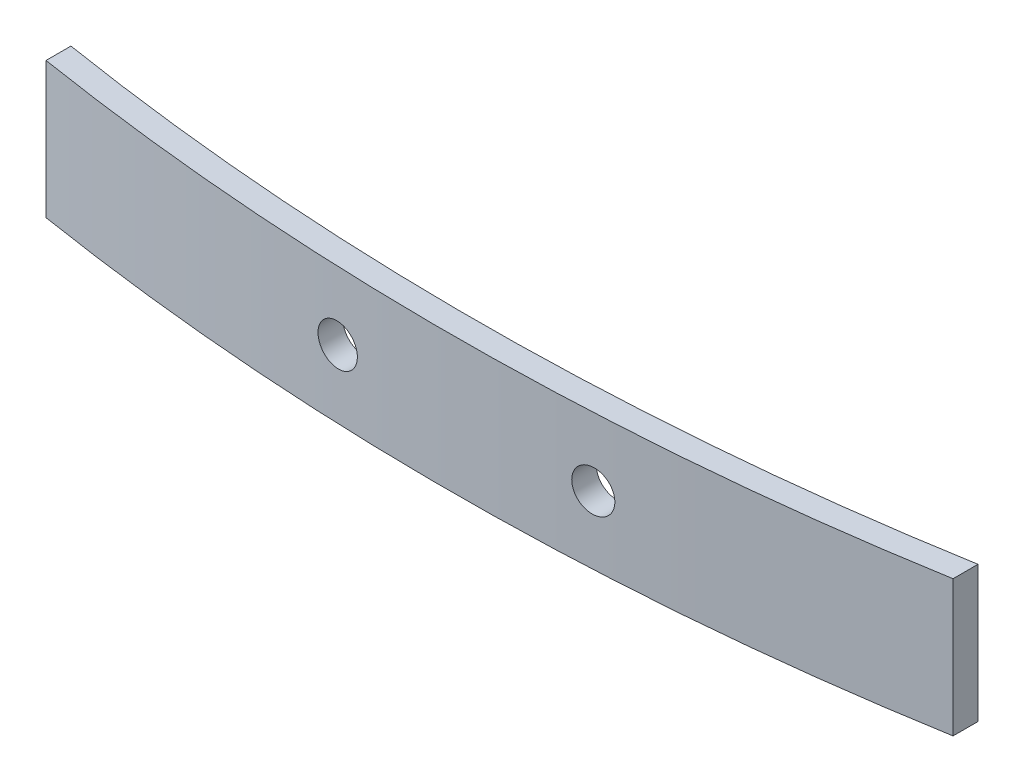
ISO-10303-21;
HEADER;
FILE_DESCRIPTION(('STEP AP214'),'2;1');
FILE_NAME('part.step','',(''),(''),'','','');
FILE_SCHEMA(('AUTOMOTIVE_DESIGN { 1 0 10303 214 1 1 1 1 }'));
ENDSEC;
DATA;
#1=APPLICATION_CONTEXT('core data for automotive mechanical design processes');
#2=APPLICATION_PROTOCOL_DEFINITION('international standard','automotive_design',2000,#1);
#3=PRODUCT_CONTEXT('',#1,'mechanical');
#4=PRODUCT('Part','Part','',(#3));
#5=PRODUCT_RELATED_PRODUCT_CATEGORY('part','',(#4));
#6=PRODUCT_DEFINITION_FORMATION('','',#4);
#7=PRODUCT_DEFINITION_CONTEXT('part definition',#1,'design');
#8=PRODUCT_DEFINITION('design','',#6,#7);
#9=PRODUCT_DEFINITION_SHAPE('','',#8);
#10=(LENGTH_UNIT() NAMED_UNIT(*) SI_UNIT(.MILLI.,.METRE.));
#11=(NAMED_UNIT(*) PLANE_ANGLE_UNIT() SI_UNIT($,.RADIAN.));
#12=(NAMED_UNIT(*) SI_UNIT($,.STERADIAN.) SOLID_ANGLE_UNIT());
#13=UNCERTAINTY_MEASURE_WITH_UNIT(LENGTH_MEASURE(1.E-05),#10,'distance_accuracy_value','');
#14=(GEOMETRIC_REPRESENTATION_CONTEXT(3) GLOBAL_UNCERTAINTY_ASSIGNED_CONTEXT((#13)) GLOBAL_UNIT_ASSIGNED_CONTEXT((#10,
#11,#12)) REPRESENTATION_CONTEXT('',''));
#15=CARTESIAN_POINT('',(0.,0.,0.));
#16=DIRECTION('',(0.,0.,1.));
#17=DIRECTION('',(1.,0.,0.));
#18=AXIS2_PLACEMENT_3D('',#15,#16,#17);
#19=CARTESIAN_POINT('',(-0.864955357188,8.3,-164.510629845193));
#20=DIRECTION('',(0.,-1.,0.));
#21=DIRECTION('',(0.,0.,-1.));
#22=AXIS2_PLACEMENT_3D('',#19,#20,#21);
#23=CYLINDRICAL_SURFACE('',#22,167.210703971618);
#24=CARTESIAN_POINT('',(-0.864955357188,0.,-164.510629845193));
#25=DIRECTION('',(0.,-1.,0.));
#26=DIRECTION('',(0.,0.,1.));
#27=AXIS2_PLACEMENT_3D('',#24,#25,#26);
#28=CIRCLE('',#27,167.210703971618);
#29=CARTESIAN_POINT('',(27.5,0.,0.276653736607457));
#30=VERTEX_POINT('',#29);
#31=CARTESIAN_POINT('',(-27.5,0.,0.565091929874167));
#32=VERTEX_POINT('',#31);
#33=EDGE_CURVE('E119',#30,#32,#28,.T.);
#34=ORIENTED_EDGE('',*,*,#33,.T.);
#35=DIRECTION('',(0.,-1.,0.));
#36=VECTOR('',#35,1.);
#37=CARTESIAN_POINT('',(-27.5,8.3,0.565091929874167));
#38=LINE('',#37,#36);
#39=CARTESIAN_POINT('',(-27.5,8.3,0.565091929874167));
#40=VERTEX_POINT('',#39);
#41=EDGE_CURVE('E11',#40,#32,#38,.T.);
#42=ORIENTED_EDGE('',*,*,#41,.F.);
#43=CARTESIAN_POINT('',(-0.864955357188,8.3,-164.510629845193));
#44=DIRECTION('',(0.,-1.,0.));
#45=DIRECTION('',(0.,0.,1.));
#46=AXIS2_PLACEMENT_3D('',#43,#44,#45);
#47=CIRCLE('',#46,167.210703971618);
#48=CARTESIAN_POINT('',(27.5,8.3,0.276653736607457));
#49=VERTEX_POINT('',#48);
#50=EDGE_CURVE('E101',#49,#40,#47,.T.);
#51=ORIENTED_EDGE('',*,*,#50,.F.);
#52=DIRECTION('',(0.,-1.,0.));
#53=VECTOR('',#52,1.);
#54=CARTESIAN_POINT('',(27.5,8.3,0.276653736607457));
#55=LINE('',#54,#53);
#56=EDGE_CURVE('E115',#49,#30,#55,.T.);
#57=ORIENTED_EDGE('',*,*,#56,.T.);
#58=EDGE_LOOP('',(#34,#42,#51,#57));
#59=FACE_BOUND('',#58,.T.);
#60=CARTESIAN_POINT('',(6.5,4.15,2.53779713115004));
#61=CARTESIAN_POINT('',(6.50000311830072,4.2201600528483,2.53779703356888));
#62=CARTESIAN_POINT('',(6.50592683250922,4.29037097447346,2.53753615101918));
#63=CARTESIAN_POINT('',(6.52947445822004,4.42885834488722,2.53649543364698));
#64=CARTESIAN_POINT('',(6.54711244591845,4.49713236319745,2.5357149744841));
#65=CARTESIAN_POINT('',(6.593583155423,4.6297187466707,2.53364651229168));
#66=CARTESIAN_POINT('',(6.62241033254543,4.69403305576497,2.53235876064082));
#67=CARTESIAN_POINT('',(6.69042977820944,4.81688874962342,2.52929601535595));
#68=CARTESIAN_POINT('',(6.72961948369922,4.87543155699319,2.52752114220171));
#69=CARTESIAN_POINT('',(6.81727240701778,4.98513523567161,2.52351282987057));
#70=CARTESIAN_POINT('',(6.86574015724651,5.03629247755706,2.52127916653188));
#71=CARTESIAN_POINT('',(6.97055942325953,5.12974635220956,2.51639484759461));
#72=CARTESIAN_POINT('',(7.02691128046353,5.17204260105485,2.51374417393686));
#73=CARTESIAN_POINT('',(7.14595131480201,5.24661412268197,2.50807702763504));
#74=CARTESIAN_POINT('',(7.2086452692116,5.27888014756526,2.50506022095671));
#75=CARTESIAN_POINT('',(7.33854573429652,5.33243009041771,2.49873012293615));
#76=CARTESIAN_POINT('',(7.40575226418267,5.35371396163058,2.4954168303317));
#77=CARTESIAN_POINT('',(7.5428494216453,5.38471994256582,2.4885709153848));
#78=CARTESIAN_POINT('',(7.61274294738313,5.39442918509865,2.48503805353334));
#79=CARTESIAN_POINT('',(7.7531616222027,5.40197190758309,2.47785036870086));
#80=CARTESIAN_POINT('',(7.82368677376782,5.39980534082174,2.47419554524016));
#81=CARTESIAN_POINT('',(7.96342985722233,5.38365274089719,2.46686575840938));
#82=CARTESIAN_POINT('',(8.0326466378837,5.36965675272819,2.46319078066725));
#83=CARTESIAN_POINT('',(8.16774794433558,5.33022812559369,2.45593678797151));
#84=CARTESIAN_POINT('',(8.23363245930642,5.30479544949665,2.45235777332949));
#85=CARTESIAN_POINT('',(8.36020377089505,5.24320862112569,2.44541222559091));
#86=CARTESIAN_POINT('',(8.42089009855844,5.20705350283695,2.4420457116723));
#87=CARTESIAN_POINT('',(8.53533088617573,5.12504404492505,2.43564124626815));
#88=CARTESIAN_POINT('',(8.58908537368798,5.07918974386402,2.4326032934764));
#89=CARTESIAN_POINT('',(8.68808413564137,4.97912437454379,2.42696754118702));
#90=CARTESIAN_POINT('',(8.73333590873341,4.92492074717713,2.42436935405706));
#91=CARTESIAN_POINT('',(8.81409389396076,4.80966323539121,2.41970643279685));
#92=CARTESIAN_POINT('',(8.8496001867816,4.74860940769255,2.41764169425003));
#93=CARTESIAN_POINT('',(8.90980168821073,4.62148553155661,2.41412733536457));
#94=CARTESIAN_POINT('',(8.93451353604402,4.55542338906069,2.41267676841059));
#95=CARTESIAN_POINT('',(8.97249675193018,4.4200775166296,2.41044259271686));
#96=CARTESIAN_POINT('',(8.98576822175059,4.3507938153575,2.40965897804425));
#97=CARTESIAN_POINT('',(9.00047882200267,4.21107570744998,2.4087901949542));
#98=CARTESIAN_POINT('',(9.00193452056621,4.14064305088972,2.40870404854379));
#99=CARTESIAN_POINT('',(8.9930154142881,4.00053370594098,2.40923102871897));
#100=CARTESIAN_POINT('',(8.98264065708287,3.93085701450969,2.40984415248887));
#101=CARTESIAN_POINT('',(8.9503655620009,3.79426844369779,2.41174509717095));
#102=CARTESIAN_POINT('',(8.92847026623645,3.72735536859114,2.4130326229213));
#103=CARTESIAN_POINT('',(8.8737837915955,3.59815694385367,2.4162320685688));
#104=CARTESIAN_POINT('',(8.84099258100937,3.53587160769127,2.41814399028308));
#105=CARTESIAN_POINT('',(8.76541982221783,3.41764155961199,2.42252092143321));
#106=CARTESIAN_POINT('',(8.72263037518888,3.36170191310341,2.42498636810516));
#107=CARTESIAN_POINT('',(8.62829367522125,3.2577981137888,2.43037761471364));
#108=CARTESIAN_POINT('',(8.57674634798289,3.20983402865227,2.43330341855572));
#109=CARTESIAN_POINT('',(8.46627103909551,3.12316384761996,2.43951479784418));
#110=CARTESIAN_POINT('',(8.40733179566604,3.08447214599152,2.4428009212656));
#111=CARTESIAN_POINT('',(8.28380750137,3.01753168134166,2.44961536945369));
#112=CARTESIAN_POINT('',(8.21922240939069,2.98928299437351,2.45314369598402));
#113=CARTESIAN_POINT('',(8.08614019581266,2.94399119053169,2.46033126551108));
#114=CARTESIAN_POINT('',(8.0176376688324,2.92696398359887,2.46399068666331));
#115=CARTESIAN_POINT('',(7.87874601955412,2.90466003783105,2.47132140491645));
#116=CARTESIAN_POINT('',(7.80835688551057,2.89938337216909,2.47499270209117));
#117=CARTESIAN_POINT('',(7.66764528599877,2.90073180929488,2.48224190393867));
#118=CARTESIAN_POINT('',(7.59732288570206,2.90736404166644,2.48581975136414));
#119=CARTESIAN_POINT('',(7.45878462599334,2.93235966108019,2.49278235889512));
#120=CARTESIAN_POINT('',(7.39056876893537,2.95072306123143,2.49616711878486));
#121=CARTESIAN_POINT('',(7.25820669782941,2.99865642610158,2.5026575116878));
#122=CARTESIAN_POINT('',(7.19405912200034,3.02822261753584,2.50576323824877));
#123=CARTESIAN_POINT('',(7.07163847251114,3.09772642357956,2.51162544242854));
#124=CARTESIAN_POINT('',(7.01336514139768,3.13766358338107,2.51438193535473));
#125=CARTESIAN_POINT('',(6.9044123768105,3.2267300456736,2.5194854771111));
#126=CARTESIAN_POINT('',(6.85372481706355,3.27584938297113,2.52183296453855));
#127=CARTESIAN_POINT('',(6.76130334568271,3.38193224768082,2.5260782387648));
#128=CARTESIAN_POINT('',(6.71957161192582,3.43889767758814,2.52797591619053));
#129=CARTESIAN_POINT('',(6.64629504219877,3.55899830925378,2.53128701689445));
#130=CARTESIAN_POINT('',(6.614743919168,3.62212967172133,2.53270073907335));
#131=CARTESIAN_POINT('',(6.56272376021015,3.75275215207936,2.53502196922212));
#132=CARTESIAN_POINT('',(6.54224136968559,3.82023790573416,2.5359300872515));
#133=CARTESIAN_POINT('',(6.51840966169869,3.93179630078508,2.53698468836411));
#134=CARTESIAN_POINT('',(6.51151470431355,3.97514204431732,2.53728912928755));
#135=CARTESIAN_POINT('',(6.50230890007655,4.06231856832874,2.53769538112666));
#136=CARTESIAN_POINT('',(6.49999805103457,4.10614934857616,2.53779719213913));
#137=CARTESIAN_POINT('',(6.5,4.15,2.53779713115004));
#138=B_SPLINE_CURVE_WITH_KNOTS('',3,(#60,#61,#62,#63,#64,#65,#66,#67,#68,#69,#70,#71,#72,#73,
#74,#75,#76,#77,#78,#79,#80,#81,#82,#83,#84,#85,#86,#87,#88,#89,#90,#91,#92,#93,#94,#95,#96,#97,
#98,#99,#100,#101,#102,#103,#104,#105,#106,#107,#108,#109,#110,#111,#112,#113,#114,#115,#116,
#117,#118,#119,#120,#121,#122,#123,#124,#125,#126,#127,#128,#129,#130,#131,#132,#133,#134,#135,
#136,#137),.UNSPECIFIED.,.T.,.F.,(4,2,2,2,2,2,2,2,2,2,2,2,2,2,2,2,2,2,2,2,2,2,2,2,2,2,2,2,2,2,2,
2,2,2,2,2,2,2,4),(0.,0.210320035472163,0.420893255693905,0.631362261542145,0.841779258925773,
1.05229931024653,1.2628284809202,1.47355118835342,1.68427479292679,1.89523243521323,
2.10619090729285,2.31732708766128,2.52846395353147,2.7396198470939,2.95077490115542,
3.1617428517856,3.37270905570111,3.58334890570873,3.79398688195663,4.00432944949815,
4.21467117007918,4.424920908374,4.63517125854935,4.84558827603943,5.05600707874424,
5.26675044568951,5.47749534738359,5.68853840640857,5.89958277963837,6.11075354241696,
6.32192454116966,6.53302447718547,6.74411515719746,6.95497806183269,7.16589218613083,
7.3766758095064,7.58720454814038,7.71865648688288,7.8501083628226),.UNSPECIFIED.);
#139=CARTESIAN_POINT('',(6.5,4.15,2.53779713115004));
#140=VERTEX_POINT('',#139);
#141=EDGE_CURVE('E140',#140,#140,#138,.T.);
#142=ORIENTED_EDGE('',*,*,#141,.F.);
#143=EDGE_LOOP('',(#142));
#144=FACE_BOUND('',#143,.T.);
#145=CARTESIAN_POINT('',(-9.,4.15,2.50206599360675));
#146=CARTESIAN_POINT('',(-8.9999968789846,4.22015392659101,2.50206618554172));
#147=CARTESIAN_POINT('',(-8.99407417658717,4.29035873068543,2.50235496193518));
#148=CARTESIAN_POINT('',(-8.97053082535261,4.42883359318577,2.50349920546083));
#149=CARTESIAN_POINT('',(-8.95289609973919,4.4971012202016,2.50435535452016));
#150=CARTESIAN_POINT('',(-8.90643478571085,4.62967430947023,2.50659881430219));
#151=CARTESIAN_POINT('',(-8.87761385256324,4.69398175481704,2.5079858566231));
#152=CARTESIAN_POINT('',(-8.80960947329652,4.81682546464163,2.51123443252684));
#153=CARTESIAN_POINT('',(-8.77042857227543,4.87536314171671,2.51309584956758));
#154=CARTESIAN_POINT('',(-8.68278601070888,4.9850703860922,2.51722102597792));
#155=CARTESIAN_POINT('',(-8.63431808054086,5.036234934716,2.51948505707536));
#156=CARTESIAN_POINT('',(-8.52949361157527,5.12970468199198,2.5243279425006));
#157=CARTESIAN_POINT('',(-8.47313672058647,5.17200948490304,2.52690681088319));
#158=CARTESIAN_POINT('',(-8.35407035350533,5.24660359631099,2.53228748153317));
#159=CARTESIAN_POINT('',(-8.29135420853412,5.27888224334472,2.53508951715917));
#160=CARTESIAN_POINT('',(-8.16139801259883,5.33245139876033,2.54081634269377));
#161=CARTESIAN_POINT('',(-8.09415794839092,5.35374187497259,2.54374113296173));
#162=CARTESIAN_POINT('',(-7.95700562805629,5.38474509749862,2.54961993904171));
#163=CARTESIAN_POINT('',(-7.88709133618139,5.39444883483721,2.55257397579667));
#164=CARTESIAN_POINT('',(-7.74662363106475,5.40197266553775,2.55841906921826));
#165=CARTESIAN_POINT('',(-7.67607021805432,5.39979276320068,2.56131012590768));
#166=CARTESIAN_POINT('',(-7.53631737546828,5.38360795028121,2.56694897423169));
#167=CARTESIAN_POINT('',(-7.46711812818554,5.36960145869888,2.56969674665963));
#168=CARTESIAN_POINT('',(-7.33204995513501,5.33015574247033,2.57497929333489));
#169=CARTESIAN_POINT('',(-7.26618102694138,5.30471652615198,2.57751406773735));
#170=CARTESIAN_POINT('',(-7.13967529197927,5.24313791888805,2.58231262134722));
#171=CARTESIAN_POINT('',(-7.07903622405426,5.20700318245829,2.58457651783571));
#172=CARTESIAN_POINT('',(-6.96468446660637,5.12505256805409,2.58878998227595));
#173=CARTESIAN_POINT('',(-6.9109717504013,5.0792367273757,2.59073955143857));
#174=CARTESIAN_POINT('',(-6.81203747553293,4.97925802415904,2.59428986539865));
#175=CARTESIAN_POINT('',(-6.76681012773489,4.9251008987258,2.59589084813945));
#176=CARTESIAN_POINT('',(-6.68608977992854,4.80995352949493,2.59872223701323));
#177=CARTESIAN_POINT('',(-6.65059674771484,4.7489633083051,2.59995264437223));
#178=CARTESIAN_POINT('',(-6.590376060798,4.62192237655231,2.6020267438483));
#179=CARTESIAN_POINT('',(-6.56564166867781,4.55587486360173,2.60287067800525));
#180=CARTESIAN_POINT('',(-6.52761073193537,4.42056138087808,2.60416370089424));
#181=CARTESIAN_POINT('',(-6.51431415871405,4.35129541915288,2.60461279061355));
#182=CARTESIAN_POINT('',(-6.49954079239336,4.21154064500586,2.60511156027287));
#183=CARTESIAN_POINT('',(-6.49805932903814,4.14105232679781,2.60516139802852));
#184=CARTESIAN_POINT('',(-6.50694607500547,4.00082757280868,2.60486160439767));
#185=CARTESIAN_POINT('',(-6.51731427167745,3.93109113622496,2.60451197343762));
#186=CARTESIAN_POINT('',(-6.54960324564899,3.7943571841506,2.60341671966623));
#187=CARTESIAN_POINT('',(-6.5715228123632,3.72735938244327,2.60267113835048));
#188=CARTESIAN_POINT('',(-6.62628963110505,3.59799583377631,2.60079195620987));
#189=CARTESIAN_POINT('',(-6.65913688578675,3.53563008794169,2.59965835529077));
#190=CARTESIAN_POINT('',(-6.73483166859743,3.41728730499127,2.59701660989913));
#191=CARTESIAN_POINT('',(-6.77768113562152,3.36131150968244,2.59550839280487));
#192=CARTESIAN_POINT('',(-6.87215792978473,3.25734839500569,2.59213873834546));
#193=CARTESIAN_POINT('',(-6.92378527798313,3.20936109480376,2.59027730013288));
#194=CARTESIAN_POINT('',(-7.0343770124007,3.12271195576185,2.58623073710219));
#195=CARTESIAN_POINT('',(-7.09334487425577,3.08405456016075,2.58404545885613));
#196=CARTESIAN_POINT('',(-7.21692291467281,3.01718732082311,2.57939334339435));
#197=CARTESIAN_POINT('',(-7.28153310692913,2.98897750244451,2.57692650549527));
#198=CARTESIAN_POINT('',(-7.41460725247868,2.94378577926695,2.57176305079366));
#199=CARTESIAN_POINT('',(-7.48307375578416,2.92681140084984,2.56906628132723));
#200=CARTESIAN_POINT('',(-7.62187848301808,2.90459846176945,2.56351038955912));
#201=CARTESIAN_POINT('',(-7.69221671793101,2.89935996999512,2.56065126630453));
#202=CARTESIAN_POINT('',(-7.83281637138237,2.90076536385271,2.55484650857032));
#203=CARTESIAN_POINT('',(-7.90307771107605,2.90741691833229,2.55190081946276));
#204=CARTESIAN_POINT('',(-8.04148512738746,2.93242782586422,2.54601247447333));
#205=CARTESIAN_POINT('',(-8.10963119421408,2.95078723310107,2.54306981860556));
#206=CARTESIAN_POINT('',(-8.241895354265,2.99870164424562,2.53728144363261));
#207=CARTESIAN_POINT('',(-8.30601218718679,3.02826013098761,2.53443575498392));
#208=CARTESIAN_POINT('',(-8.42837082553149,3.09773467630274,2.52894039080036));
#209=CARTESIAN_POINT('',(-8.48661286568478,3.13765032082243,2.52629070743512));
#210=CARTESIAN_POINT('',(-8.5955437277431,3.22668945212403,2.52128478020098));
#211=CARTESIAN_POINT('',(-8.64623586141244,3.27580888019099,2.51892840774627));
#212=CARTESIAN_POINT('',(-8.73866512901045,3.38189143455903,2.51459688510446));
#213=CARTESIAN_POINT('',(-8.78040007437305,3.43885647225799,2.51262182809836));
#214=CARTESIAN_POINT('',(-8.85368941957521,3.55896764454512,2.50913246037367));
#215=CARTESIAN_POINT('',(-8.88524832561627,3.62211102701864,2.5076179457325));
#216=CARTESIAN_POINT('',(-8.93727980646051,3.75276028135037,2.50511128627954));
#217=CARTESIAN_POINT('',(-8.95776576458918,3.82026077596767,2.50411851090768));
#218=CARTESIAN_POINT('',(-8.98159577176555,3.931828323578,2.50296166374095));
#219=CARTESIAN_POINT('',(-8.9884886838119,3.97516767163756,2.50262636687851));
#220=CARTESIAN_POINT('',(-8.9976917716211,4.06233138927276,2.50217847191128));
#221=CARTESIAN_POINT('',(-9.00000195054731,4.10615575851357,2.50206587365277));
#222=CARTESIAN_POINT('',(-9.,4.15,2.50206599360675));
#223=B_SPLINE_CURVE_WITH_KNOTS('',3,(#145,#146,#147,#148,#149,#150,#151,#152,#153,#154,#155,
#156,#157,#158,#159,#160,#161,#162,#163,#164,#165,#166,#167,#168,#169,#170,#171,#172,#173,#174,
#175,#176,#177,#178,#179,#180,#181,#182,#183,#184,#185,#186,#187,#188,#189,#190,#191,#192,#193,
#194,#195,#196,#197,#198,#199,#200,#201,#202,#203,#204,#205,#206,#207,#208,#209,#210,#211,#212,
#213,#214,#215,#216,#217,#218,#219,#220,#221,#222),.UNSPECIFIED.,.T.,.F.,(4,2,2,2,2,2,2,2,2,2,2,
2,2,2,2,2,2,2,2,2,2,2,2,2,2,2,2,2,2,2,2,2,2,2,2,2,2,2,4),(0.,0.210301643941587,
0.420856509681721,0.631305066265064,0.841701970625624,1.05224141643252,1.26279026446753,
1.47356224230451,1.68433483720616,1.89527120650513,2.10620749946128,2.3171719952294,
2.52813633732614,2.73900900582891,2.94988086196861,3.16060832361605,3.37133508807649,
3.58192969779077,3.79252378093362,4.00303461668978,4.21354522770696,4.42403378156556,
4.6345223865464,4.84505182796709,5.05558177448261,5.26621178602277,5.47684230879222,
5.68761378604787,5.89838650051611,6.10929520832399,6.32020489223412,6.53118022147071,
6.74214711773653,6.95302119914314,7.16394674622767,7.37477876158737,7.58535538162698,
7.71678811639713,7.84822076044173),.UNSPECIFIED.);
#224=CARTESIAN_POINT('',(-9.,4.15,2.50206599360675));
#225=VERTEX_POINT('',#224);
#226=EDGE_CURVE('E123',#225,#225,#223,.T.);
#227=ORIENTED_EDGE('',*,*,#226,.F.);
#228=EDGE_LOOP('',(#227));
#229=FACE_BOUND('',#228,.T.);
#230=ADVANCED_FACE('F41',(#59,#144,#229),#23,.F.);
#231=CARTESIAN_POINT('',(-0.864955357188,8.3,-164.510629845193));
#232=DIRECTION('',(0.,-1.,0.));
#233=DIRECTION('',(0.,0.,-1.));
#234=AXIS2_PLACEMENT_3D('',#231,#232,#233);
#235=CYLINDRICAL_SURFACE('',#234,168.710703971618);
#236=CARTESIAN_POINT('',(-0.864955357188,0.,-164.510629845193));
#237=DIRECTION('',(0.,1.,0.));
#238=DIRECTION('',(0.,0.,1.));
#239=AXIS2_PLACEMENT_3D('',#236,#237,#238);
#240=CIRCLE('',#239,168.710703971618);
#241=CARTESIAN_POINT('',(-27.5,0.,2.08431615099947));
#242=VERTEX_POINT('',#241);
#243=CARTESIAN_POINT('',(27.5,0.,1.79851284450885));
#244=VERTEX_POINT('',#243);
#245=EDGE_CURVE('E83',#242,#244,#240,.T.);
#246=ORIENTED_EDGE('',*,*,#245,.T.);
#247=DIRECTION('',(0.,-1.,0.));
#248=VECTOR('',#247,1.);
#249=CARTESIAN_POINT('',(27.5,8.3,1.79851284450885));
#250=LINE('',#249,#248);
#251=CARTESIAN_POINT('',(27.5,8.3,1.79851284450885));
#252=VERTEX_POINT('',#251);
#253=EDGE_CURVE('E108',#252,#244,#250,.T.);
#254=ORIENTED_EDGE('',*,*,#253,.F.);
#255=CARTESIAN_POINT('',(-0.864955357188,8.3,-164.510629845193));
#256=DIRECTION('',(0.,1.,0.));
#257=DIRECTION('',(0.,0.,1.));
#258=AXIS2_PLACEMENT_3D('',#255,#256,#257);
#259=CIRCLE('',#258,168.710703971618);
#260=CARTESIAN_POINT('',(-27.5,8.3,2.08431615099947));
#261=VERTEX_POINT('',#260);
#262=EDGE_CURVE('E99',#261,#252,#259,.T.);
#263=ORIENTED_EDGE('',*,*,#262,.F.);
#264=DIRECTION('',(0.,-1.,0.));
#265=VECTOR('',#264,1.);
#266=CARTESIAN_POINT('',(-27.5,8.3,2.08431615099947));
#267=LINE('',#266,#265);
#268=EDGE_CURVE('E57',#261,#242,#267,.T.);
#269=ORIENTED_EDGE('',*,*,#268,.T.);
#270=EDGE_LOOP('',(#246,#254,#263,#269));
#271=FACE_BOUND('',#270,.T.);
#272=CARTESIAN_POINT('',(6.5,4.15,4.03924131223476));
#273=CARTESIAN_POINT('',(6.50000311821644,4.07983900859695,4.03924121552748));
#274=CARTESIAN_POINT('',(6.50592698943899,4.00962714769121,4.03898265006684));
#275=CARTESIAN_POINT('',(6.52947525777152,3.87113790994845,4.03795117528823));
#276=CARTESIAN_POINT('',(6.54711373158644,3.80286296362511,4.0371776471692));
#277=CARTESIAN_POINT('',(6.5935857873165,3.67027474837752,4.03512755161367));
#278=CARTESIAN_POINT('',(6.62241382786342,3.60595953672604,4.03385123316753));
#279=CARTESIAN_POINT('',(6.69043542031096,3.48310215407869,4.03081567544885));
#280=CARTESIAN_POINT('',(6.72962640880317,3.42455856030873,4.02905655559936));
#281=CARTESIAN_POINT('',(6.8172820530594,3.31485390784877,4.02508382682747));
#282=CARTESIAN_POINT('',(6.86575117837123,3.26369642818558,4.02286999882129));
#283=CARTESIAN_POINT('',(6.97057354743463,3.17024232360844,4.01802904805097));
#284=CARTESIAN_POINT('',(7.02692713205723,3.12794608199243,4.01540190741736));
#285=CARTESIAN_POINT('',(7.14596995548139,3.0533755885601,4.00978511600482));
#286=CARTESIAN_POINT('',(7.20866486743313,3.02111041785869,4.00679514013587));
#287=CARTESIAN_POINT('',(7.33856734711277,2.96756235584867,4.0005213413924));
#288=CARTESIAN_POINT('',(7.40577493355283,2.9462795100823,3.99723751729939));
#289=CARTESIAN_POINT('',(7.54287287382637,2.91527615684631,3.9904525607616));
#290=CARTESIAN_POINT('',(7.61276607455011,2.90556828916056,3.98695119514316));
#291=CARTESIAN_POINT('',(7.75318398462447,2.8980281750774,3.97982760071573));
#292=CARTESIAN_POINT('',(7.82370869639393,2.90019597418601,3.97620537144366));
#293=CARTESIAN_POINT('',(7.96344967877755,2.91635077058775,3.96894102179307));
#294=CARTESIAN_POINT('',(8.03266481846192,2.93034754597473,3.96529888743595));
#295=CARTESIAN_POINT('',(8.16776273741988,2.96977719915022,3.95810974015306));
#296=CARTESIAN_POINT('',(8.23364550600481,2.99521011361783,3.95456272753242));
#297=CARTESIAN_POINT('',(8.36021317750195,3.05679674125216,3.94767930532073));
#298=CARTESIAN_POINT('',(8.42089762011192,3.09295140254778,3.94434291438671));
#299=CARTESIAN_POINT('',(8.53533475109379,3.17495920939541,3.93799576571538));
#300=CARTESIAN_POINT('',(8.58908746658606,3.22081231700043,3.93498500670404));
#301=CARTESIAN_POINT('',(8.68808377782325,3.32087531831846,3.92939965986203));
#302=CARTESIAN_POINT('',(8.73333473937803,3.37507790335134,3.92682469465891));
#303=CARTESIAN_POINT('',(8.81409134650165,3.49033280947923,3.92220344736401));
#304=CARTESIAN_POINT('',(8.84959707129266,3.5513850748853,3.92015716097442));
#305=CARTESIAN_POINT('',(8.9097987203869,3.67850714182677,3.91667414586709));
#306=CARTESIAN_POINT('',(8.93451098835277,3.74456917818108,3.91523649564267));
#307=CARTESIAN_POINT('',(8.97249503617838,3.87991472439955,3.9130222036996));
#308=CARTESIAN_POINT('',(8.98576691600336,3.9491982061094,3.91224555620515));
#309=CARTESIAN_POINT('',(9.00047858396002,4.08891761505717,3.91138446160091));
#310=CARTESIAN_POINT('',(9.00193464639936,4.15935182324617,3.91129906241287));
#311=CARTESIAN_POINT('',(8.9930157402488,4.29946432254685,3.91182132938171));
#312=CARTESIAN_POINT('',(8.98264081844691,4.36914261664686,3.91242899279773));
#313=CARTESIAN_POINT('',(8.95036468700418,4.50573494537357,3.91431303885405));
#314=CARTESIAN_POINT('',(8.92846843044031,4.5726501545421,3.91558913413124));
#315=CARTESIAN_POINT('',(8.87377921065577,4.70185269258961,3.91876019569581));
#316=CARTESIAN_POINT('',(8.8409862163099,4.76414000824897,3.92065516375093));
#317=CARTESIAN_POINT('',(8.76540956464805,4.88237282754171,3.92499327057981));
#318=CARTESIAN_POINT('',(8.72261814798466,4.93831335535867,3.92743683503779));
#319=CARTESIAN_POINT('',(8.62827692294248,5.04221853556737,3.93278024197428));
#320=CARTESIAN_POINT('',(8.57672704150597,5.09018312142211,3.93568008825879));
#321=CARTESIAN_POINT('',(8.46624763257672,5.17685250771872,3.94183628410163));
#322=CARTESIAN_POINT('',(8.40730704222217,5.21554316817252,3.94509316715556));
#323=CARTESIAN_POINT('',(8.28378001097383,5.28248131570165,3.95184697684577));
#324=CARTESIAN_POINT('',(8.21919352979874,5.31072872826082,3.95534390519465));
#325=CARTESIAN_POINT('',(8.08611029795493,5.35601708706464,3.96246741698823));
#326=CARTESIAN_POINT('',(8.01760823799984,5.37304240537618,3.9660941738585));
#327=CARTESIAN_POINT('',(7.87871783527179,5.39534282461644,3.97335944682003));
#328=CARTESIAN_POINT('',(7.80832948090368,5.4006178532987,3.97699796298346));
#329=CARTESIAN_POINT('',(7.66762053519389,5.39926646401132,3.98418238604978));
#330=CARTESIAN_POINT('',(7.59730000806059,5.39263304400314,3.98772823722281));
#331=CARTESIAN_POINT('',(7.45876575456234,5.36763572035665,3.99462856946874));
#332=CARTESIAN_POINT('',(7.39055203058462,5.34927180342702,3.9979830503248));
#333=CARTESIAN_POINT('',(7.25819393508083,5.30133802586427,4.00441539585197));
#334=CARTESIAN_POINT('',(7.19404822705777,5.2717718680891,4.00749335151198));
#335=CARTESIAN_POINT('',(7.07163132096953,5.20226884492976,4.0133031329288));
#336=CARTESIAN_POINT('',(7.01335986592901,5.16233243347673,4.01603497382811));
#337=CARTESIAN_POINT('',(6.90440970126537,5.0732674380006,4.02109291899384));
#338=CARTESIAN_POINT('',(6.85372299555039,5.02414865901682,4.02341945098137));
#339=CARTESIAN_POINT('',(6.76130311542266,4.9180673552612,4.02762682906566));
#340=CARTESIAN_POINT('',(6.71957211975892,4.86110292731781,4.02950756672099));
#341=CARTESIAN_POINT('',(6.64629602031458,4.74100352127971,4.03278914867204));
#342=CARTESIAN_POINT('',(6.61474482710605,4.67787226166189,4.03419027989289));
#343=CARTESIAN_POINT('',(6.5627245280606,4.54725012163237,4.03649083798607));
#344=CARTESIAN_POINT('',(6.54224206886014,4.47976460478743,4.03739086942698));
#345=CARTESIAN_POINT('',(6.51841005492601,4.36820601693854,4.03843608951054));
#346=CARTESIAN_POINT('',(6.5115149493841,4.32485980916441,4.03873782494768));
#347=CARTESIAN_POINT('',(6.50230894854312,4.23768235789113,4.03914046648403));
#348=CARTESIAN_POINT('',(6.49999805109272,4.19385111461962,4.0392413726775));
#349=CARTESIAN_POINT('',(6.5,4.15,4.03924131223476));
#350=B_SPLINE_CURVE_WITH_KNOTS('',3,(#272,#273,#274,#275,#276,#277,#278,#279,#280,#281,#282,
#283,#284,#285,#286,#287,#288,#289,#290,#291,#292,#293,#294,#295,#296,#297,#298,#299,#300,#301,
#302,#303,#304,#305,#306,#307,#308,#309,#310,#311,#312,#313,#314,#315,#316,#317,#318,#319,#320,
#321,#322,#323,#324,#325,#326,#327,#328,#329,#330,#331,#332,#333,#334,#335,#336,#337,#338,#339,
#340,#341,#342,#343,#344,#345,#346,#347,#348,#349),.UNSPECIFIED.,.T.,.F.,(4,2,2,2,2,2,2,2,2,2,2,
2,2,2,2,2,2,2,2,2,2,2,2,2,2,2,2,2,2,2,2,2,2,2,2,2,2,2,4),(0.,0.21032285065951,0.420898891500716,
0.631370782317331,0.841790658830802,1.0523121569659,1.26284275944984,1.47356340371594,
1.68428492180584,1.89523633598719,2.10618855850775,2.31731532956252,2.52844277776863,
2.73958890164003,2.95073419937743,3.16169571135771,3.372655508313,3.58329474891462,
3.79393214894812,4.0042793819482,4.21462578309076,4.42488182910304,4.63513847569105,
4.84555883861547,5.05598095682341,5.26672189415471,5.47746433516598,5.68849964034594,
5.89953624306924,6.11069697366875,6.32185794352577,6.53294917573723,6.74403116953091,
6.95488904180111,7.16579815365963,7.37658086745767,7.58710872125056,7.71856204845135,
7.85001531396198),.UNSPECIFIED.);
#351=CARTESIAN_POINT('',(6.5,4.15,4.03924131223476));
#352=VERTEX_POINT('',#351);
#353=EDGE_CURVE('E133',#352,#352,#350,.T.);
#354=ORIENTED_EDGE('',*,*,#353,.F.);
#355=EDGE_LOOP('',(#354));
#356=FACE_BOUND('',#355,.T.);
#357=CARTESIAN_POINT('',(-9.,4.15,4.00382853526265));
#358=CARTESIAN_POINT('',(-8.99999687911659,4.07984502633881,4.00382872548164));
#359=CARTESIAN_POINT('',(-8.99407400179579,4.00963917459052,4.00411493681468));
#360=CARTESIAN_POINT('',(-8.97052993227765,3.87116222315919,4.00524901773181));
#361=CARTESIAN_POINT('',(-8.95289466280278,3.80289355488584,4.00609756318999));
#362=CARTESIAN_POINT('',(-8.90643183624862,3.67031839828944,4.00832110235648));
#363=CARTESIAN_POINT('',(-8.87760992916895,3.60600992876898,4.00969583030262));
#364=CARTESIAN_POINT('',(-8.80960313648298,3.48316431773872,4.01291557040369));
#365=CARTESIAN_POINT('',(-8.77042079664787,3.42462576328645,4.0147604670245));
#366=CARTESIAN_POINT('',(-8.68277533044708,3.31491760773199,4.01884901705911));
#367=CARTESIAN_POINT('',(-8.63430602799477,3.26375295037439,4.02109293576179));
#368=CARTESIAN_POINT('',(-8.52947854701956,3.17028325362986,4.02589280206471));
#369=CARTESIAN_POINT('',(-8.47312001704397,3.12797860915227,4.02844876356532));
#370=CARTESIAN_POINT('',(-8.35405132597718,3.05338592633764,4.03378158953748));
#371=CARTESIAN_POINT('',(-8.29133461612006,3.02110835755454,4.03655868112286));
#372=CARTESIAN_POINT('',(-8.16137739190089,2.96754142454835,4.04223452149233));
#373=CARTESIAN_POINT('',(-8.09413686469101,2.94625209153383,4.04513327062193));
#374=CARTESIAN_POINT('',(-7.95698473984485,2.91525144961586,4.05095968793791));
#375=CARTESIAN_POINT('',(-7.88707114263138,2.90554899028414,4.0538873765086));
#376=CARTESIAN_POINT('',(-7.74660507509065,2.89802743411505,4.05968032894632));
#377=CARTESIAN_POINT('',(-7.67605260501102,2.90020833267169,4.06254559283755));
#378=CARTESIAN_POINT('',(-7.53630204073127,2.91639476988055,4.06813412100627));
#379=CARTESIAN_POINT('',(-7.46710412560258,2.9304018612907,4.07085736658715));
#380=CARTESIAN_POINT('',(-7.33203875687078,2.96984829741077,4.07609275666334));
#381=CARTESIAN_POINT('',(-7.26617130094693,2.99528763415434,4.07860490130573));
#382=CARTESIAN_POINT('',(-7.13966804400318,3.05686618297633,4.08336063124952));
#383=CARTESIAN_POINT('',(-7.07903002178616,3.0930008230405,4.08560433073118));
#384=CARTESIAN_POINT('',(-6.96468033953217,3.17495082904334,4.08978020395954));
#385=CARTESIAN_POINT('',(-6.910968653237,3.22076615828014,4.09171237888727));
#386=CARTESIAN_POINT('',(-6.81203568189268,3.32074403246828,4.09523103941781));
#387=CARTESIAN_POINT('',(-6.7668087103755,3.3749009422332,4.09681775666216));
#388=CARTESIAN_POINT('',(-6.68608906974859,3.49004766447824,4.099623916117));
#389=CARTESIAN_POINT('',(-6.65059636902787,3.55103745476841,4.10084335952017));
#390=CARTESIAN_POINT('',(-6.59037587397156,3.67807805335364,4.10289899008837));
#391=CARTESIAN_POINT('',(-6.56564146166092,3.7441257207938,4.1037354128858));
#392=CARTESIAN_POINT('',(-6.52761053999915,3.87943945419578,4.10501692589383));
#393=CARTESIAN_POINT('',(-6.51431400254687,3.94870551225006,4.10546201706586));
#394=CARTESIAN_POINT('',(-6.49954068272828,4.08846093813965,4.10595634563385));
#395=CARTESIAN_POINT('',(-6.4980593128397,4.15894982052913,4.10600573666991));
#396=CARTESIAN_POINT('',(-6.50694643352966,4.2991756813677,4.10570859894667));
#397=CARTESIAN_POINT('',(-6.51731491169092,4.36891266060462,4.10536207060224));
#398=CARTESIAN_POINT('',(-6.54960467747415,4.50564779266525,4.10427653892875));
#399=CARTESIAN_POINT('',(-6.57152477595895,4.57264622663315,4.10353757599731));
#400=CARTESIAN_POINT('',(-6.62629291903029,4.70201096155937,4.10167507510694));
#401=CARTESIAN_POINT('',(-6.65914096619861,4.76437726142334,4.10055153705716));
#402=CARTESIAN_POINT('',(-6.73483748338904,4.88272081569556,4.09793324529946));
#403=CARTESIAN_POINT('',(-6.77768785801902,4.93869685026548,4.09643842088903));
#404=CARTESIAN_POINT('',(-6.87216669824594,5.04266029116125,4.09309868681946));
#405=CARTESIAN_POINT('',(-6.92379518459326,5.09064767860237,4.09125377633278));
#406=CARTESIAN_POINT('',(-7.03438895685658,5.17729639056959,4.0872431574274));
#407=CARTESIAN_POINT('',(-7.09335765702355,5.21595335035499,4.08507729963235));
#408=CARTESIAN_POINT('',(-7.21693747812557,5.28281956528464,4.08046652729414));
#409=CARTESIAN_POINT('',(-7.28154861240822,5.31102879571317,4.07802161209083));
#410=CARTESIAN_POINT('',(-7.41462391435739,5.35621884561702,4.07290407615886));
#411=CARTESIAN_POINT('',(-7.48309058688707,5.37319227193467,4.07023130680498));
#412=CARTESIAN_POINT('',(-7.62189560354946,5.39540329847674,4.06472486484135));
#413=CARTESIAN_POINT('',(-7.6922339585318,5.40064083065635,4.06189119129877));
#414=CARTESIAN_POINT('',(-7.83283294164632,5.39923349667971,4.05613814320306));
#415=CARTESIAN_POINT('',(-7.90309349226969,5.39258109803718,4.05321871547562));
#416=CARTESIAN_POINT('',(-8.0414992258176,5.36756875817565,4.04738287567715));
#417=CARTESIAN_POINT('',(-8.10964439904904,5.34920876331834,4.04446646362));
#418=CARTESIAN_POINT('',(-8.24190632413181,5.30129360135098,4.03872973741515));
#419=CARTESIAN_POINT('',(-8.30602183675092,5.27173500981302,4.0359094529502));
#420=CARTESIAN_POINT('',(-8.42837783584382,5.20226072346568,4.03046315648649));
#421=CARTESIAN_POINT('',(-8.48661855697557,5.16234544256329,4.02783713672929));
#422=CARTESIAN_POINT('',(-8.59554720868316,5.07330728731344,4.02287590753866));
#423=CARTESIAN_POINT('',(-8.6462384064779,5.02418841692206,4.0205405723775));
#424=CARTESIAN_POINT('',(-8.73866594265723,4.91810741345729,4.01624772407035));
#425=CARTESIAN_POINT('',(-8.78040009179382,4.86114336846859,4.01429030330448));
#426=CARTESIAN_POINT('',(-8.8536887365792,4.74103360551672,4.0108320621181));
#427=CARTESIAN_POINT('',(-8.88524757256399,4.67789053827158,4.00933104703082));
#428=CARTESIAN_POINT('',(-8.93727898823586,4.54724209802388,4.00684672857181));
#429=CARTESIAN_POINT('',(-8.95776494950587,4.47974210136188,4.00586280034001));
#430=CARTESIAN_POINT('',(-8.98159528779054,4.36817452940942,4.00471624674527));
#431=CARTESIAN_POINT('',(-8.98848838216598,4.3248346100846,4.00438392917411));
#432=CARTESIAN_POINT('',(-8.99769171194752,4.23766975108637,4.00394001406698));
#433=CARTESIAN_POINT('',(-9.00000195046108,4.19384481174185,4.00382841638134));
#434=CARTESIAN_POINT('',(-9.,4.15,4.00382853526265));
#435=B_SPLINE_CURVE_WITH_KNOTS('',3,(#357,#358,#359,#360,#361,#362,#363,#364,#365,#366,#367,
#368,#369,#370,#371,#372,#373,#374,#375,#376,#377,#378,#379,#380,#381,#382,#383,#384,#385,#386,
#387,#388,#389,#390,#391,#392,#393,#394,#395,#396,#397,#398,#399,#400,#401,#402,#403,#404,#405,
#406,#407,#408,#409,#410,#411,#412,#413,#414,#415,#416,#417,#418,#419,#420,#421,#422,#423,#424,
#425,#426,#427,#428,#429,#430,#431,#432,#433,#434),.UNSPECIFIED.,.T.,.F.,(4,2,2,2,2,2,2,2,2,2,2,
2,2,2,2,2,2,2,2,2,2,2,2,2,2,2,2,2,2,2,2,2,2,2,2,2,2,2,4),(0.,0.210304784924287,
0.420862796470645,0.631314600245847,0.841714739667695,1.05225528970966,1.26280522198902,
1.47357426219802,1.6843439010257,1.89527441418617,2.10620484558988,2.31716297608868,
2.52812095958496,2.73898889296234,2.94985602690159,3.16058132853005,3.37130594584302,
3.58190075166872,3.79249504009312,4.00300755625049,4.21351985181548,4.4240104812328,
4.63450116037917,4.84503195316072,5.0555632436183,5.26619282980732,5.47682291427,
5.68759145590011,5.89836121956493,6.10926455702065,6.32016886073649,6.53113770917181,
6.74209812749672,6.95296698118833,7.16388731610166,7.37471756238857,7.58529244713096,
7.71672689111227,7.8481612459728),.UNSPECIFIED.);
#436=CARTESIAN_POINT('',(-9.,4.15,4.00382853526265));
#437=VERTEX_POINT('',#436);
#438=EDGE_CURVE('E45',#437,#437,#435,.T.);
#439=ORIENTED_EDGE('',*,*,#438,.F.);
#440=EDGE_LOOP('',(#439));
#441=FACE_BOUND('',#440,.T.);
#442=ADVANCED_FACE('F110',(#271,#356,#441),#235,.T.);
#443=CARTESIAN_POINT('',(-27.5,8.3,0.565091929874167));
#444=DIRECTION('',(1.,0.,0.));
#445=DIRECTION('',(0.,0.,-1.));
#446=AXIS2_PLACEMENT_3D('',#443,#444,#445);
#447=PLANE('',#446);
#448=DIRECTION('',(0.,0.,1.));
#449=VECTOR('',#448,1.);
#450=CARTESIAN_POINT('',(-27.5,0.,0.565091929874167));
#451=LINE('',#450,#449);
#452=EDGE_CURVE('E106',#32,#242,#451,.T.);
#453=ORIENTED_EDGE('',*,*,#452,.T.);
#454=ORIENTED_EDGE('',*,*,#268,.F.);
#455=DIRECTION('',(0.,0.,1.));
#456=VECTOR('',#455,1.);
#457=CARTESIAN_POINT('',(-27.5,8.3,0.565091929874167));
#458=LINE('',#457,#456);
#459=EDGE_CURVE('E96',#40,#261,#458,.T.);
#460=ORIENTED_EDGE('',*,*,#459,.F.);
#461=ORIENTED_EDGE('',*,*,#41,.T.);
#462=EDGE_LOOP('',(#453,#454,#460,#461));
#463=FACE_BOUND('',#462,.T.);
#464=ADVANCED_FACE('F105',(#463),#447,.F.);
#465=CARTESIAN_POINT('',(27.5,8.3,0.276653736607457));
#466=DIRECTION('',(-1.,0.,0.));
#467=DIRECTION('',(0.,0.,1.));
#468=AXIS2_PLACEMENT_3D('',#465,#466,#467);
#469=PLANE('',#468);
#470=DIRECTION('',(0.,0.,-1.));
#471=VECTOR('',#470,1.);
#472=CARTESIAN_POINT('',(27.5,0.,0.276653736607457));
#473=LINE('',#472,#471);
#474=EDGE_CURVE('E89',#244,#30,#473,.T.);
#475=ORIENTED_EDGE('',*,*,#474,.T.);
#476=ORIENTED_EDGE('',*,*,#56,.F.);
#477=DIRECTION('',(0.,0.,-1.));
#478=VECTOR('',#477,1.);
#479=CARTESIAN_POINT('',(27.5,8.3,0.276653736607457));
#480=LINE('',#479,#478);
#481=EDGE_CURVE('E66',#252,#49,#480,.T.);
#482=ORIENTED_EDGE('',*,*,#481,.F.);
#483=ORIENTED_EDGE('',*,*,#253,.T.);
#484=EDGE_LOOP('',(#475,#476,#482,#483));
#485=FACE_BOUND('',#484,.T.);
#486=ADVANCED_FACE('F177',(#485),#469,.F.);
#487=CARTESIAN_POINT('',(-0.864955357188,8.3,-164.510629845193));
#488=DIRECTION('',(0.,1.,0.));
#489=DIRECTION('',(0.,0.,1.));
#490=AXIS2_PLACEMENT_3D('',#487,#488,#489);
#491=PLANE('',#490);
#492=ORIENTED_EDGE('',*,*,#50,.T.);
#493=ORIENTED_EDGE('',*,*,#459,.T.);
#494=ORIENTED_EDGE('',*,*,#262,.T.);
#495=ORIENTED_EDGE('',*,*,#481,.T.);
#496=EDGE_LOOP('',(#492,#493,#494,#495));
#497=FACE_BOUND('',#496,.T.);
#498=ADVANCED_FACE('F97',(#497),#491,.T.);
#499=CARTESIAN_POINT('',(-0.864955357188,0.,-164.510629845193));
#500=DIRECTION('',(0.,1.,0.));
#501=DIRECTION('',(0.,0.,1.));
#502=AXIS2_PLACEMENT_3D('',#499,#500,#501);
#503=PLANE('',#502);
#504=ORIENTED_EDGE('',*,*,#33,.F.);
#505=ORIENTED_EDGE('',*,*,#474,.F.);
#506=ORIENTED_EDGE('',*,*,#245,.F.);
#507=ORIENTED_EDGE('',*,*,#452,.F.);
#508=EDGE_LOOP('',(#504,#505,#506,#507));
#509=FACE_BOUND('',#508,.T.);
#510=ADVANCED_FACE('F148',(#509),#503,.F.);
#511=CARTESIAN_POINT('',(7.75,4.15,0.276653736607457));
#512=DIRECTION('',(0.,0.,-1.));
#513=DIRECTION('',(-1.,0.,0.));
#514=AXIS2_PLACEMENT_3D('',#511,#512,#513);
#515=CYLINDRICAL_SURFACE('',#514,1.25);
#516=ORIENTED_EDGE('',*,*,#353,.T.);
#517=EDGE_LOOP('',(#516));
#518=FACE_BOUND('',#517,.T.);
#519=ORIENTED_EDGE('',*,*,#141,.T.);
#520=EDGE_LOOP('',(#519));
#521=FACE_BOUND('',#520,.T.);
#522=ADVANCED_FACE('F143',(#518,#521),#515,.F.);
#523=CARTESIAN_POINT('',(-7.75,4.15,0.276653736607457));
#524=DIRECTION('',(0.,0.,-1.));
#525=DIRECTION('',(-1.,0.,0.));
#526=AXIS2_PLACEMENT_3D('',#523,#524,#525);
#527=CYLINDRICAL_SURFACE('',#526,1.25);
#528=ORIENTED_EDGE('',*,*,#438,.T.);
#529=EDGE_LOOP('',(#528));
#530=FACE_BOUND('',#529,.T.);
#531=ORIENTED_EDGE('',*,*,#226,.T.);
#532=EDGE_LOOP('',(#531));
#533=FACE_BOUND('',#532,.T.);
#534=ADVANCED_FACE('F147',(#530,#533),#527,.F.);
#535=CLOSED_SHELL('',(#230,#442,#464,#486,#498,#510,#522,#534));
#536=MANIFOLD_SOLID_BREP('B2',#535);
#537=ADVANCED_BREP_SHAPE_REPRESENTATION('',(#18,#536),#14);
#538=SHAPE_DEFINITION_REPRESENTATION(#9,#537);
ENDSEC;
END-ISO-10303-21;
